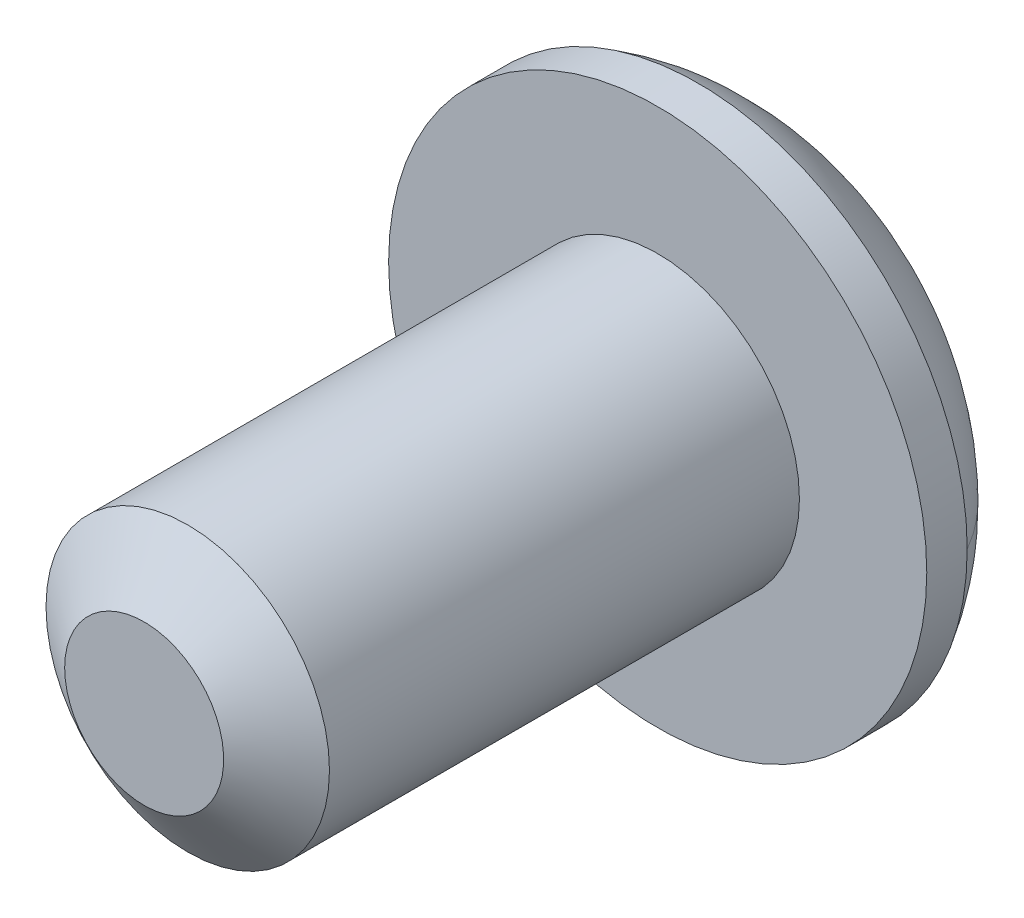
ISO-10303-21;
HEADER;
FILE_DESCRIPTION(('STEP AP214'),'2;1');
FILE_NAME('part.step','',(''),(''),'','','');
FILE_SCHEMA(('AUTOMOTIVE_DESIGN { 1 0 10303 214 1 1 1 1 }'));
ENDSEC;
DATA;
#1=APPLICATION_CONTEXT('core data for automotive mechanical design processes');
#2=APPLICATION_PROTOCOL_DEFINITION('international standard','automotive_design',2000,#1);
#3=PRODUCT_CONTEXT('',#1,'mechanical');
#4=PRODUCT('Part','Part','',(#3));
#5=PRODUCT_RELATED_PRODUCT_CATEGORY('part','',(#4));
#6=PRODUCT_DEFINITION_FORMATION('','',#4);
#7=PRODUCT_DEFINITION_CONTEXT('part definition',#1,'design');
#8=PRODUCT_DEFINITION('design','',#6,#7);
#9=PRODUCT_DEFINITION_SHAPE('','',#8);
#10=(LENGTH_UNIT() NAMED_UNIT(*) SI_UNIT(.MILLI.,.METRE.));
#11=(NAMED_UNIT(*) PLANE_ANGLE_UNIT() SI_UNIT($,.RADIAN.));
#12=(NAMED_UNIT(*) SI_UNIT($,.STERADIAN.) SOLID_ANGLE_UNIT());
#13=UNCERTAINTY_MEASURE_WITH_UNIT(LENGTH_MEASURE(1.E-05),#10,'distance_accuracy_value','');
#14=(GEOMETRIC_REPRESENTATION_CONTEXT(3) GLOBAL_UNCERTAINTY_ASSIGNED_CONTEXT((#13)) GLOBAL_UNIT_ASSIGNED_CONTEXT((#10,
#11,#12)) REPRESENTATION_CONTEXT('',''));
#15=CARTESIAN_POINT('',(0.,0.,0.));
#16=DIRECTION('',(0.,0.,1.));
#17=DIRECTION('',(1.,0.,0.));
#18=AXIS2_PLACEMENT_3D('',#15,#16,#17);
#19=CARTESIAN_POINT('',(-0.994840783,-0.994840783,0.));
#20=DIRECTION('',(0.,0.,1.));
#21=DIRECTION('',(1.,0.,0.));
#22=AXIS2_PLACEMENT_3D('',#19,#20,#21);
#23=PLANE('',#22);
#24=CARTESIAN_POINT('',(0.,0.,0.));
#25=DIRECTION('',(0.,0.,-1.));
#26=DIRECTION('',(-1.,0.,0.));
#27=AXIS2_PLACEMENT_3D('',#24,#25,#26);
#28=CIRCLE('',#27,0.983044252);
#29=CARTESIAN_POINT('',(-0.983044252,0.,0.));
#30=VERTEX_POINT('',#29);
#31=EDGE_CURVE('E22',#30,#30,#28,.F.);
#32=ORIENTED_EDGE('',*,*,#31,.T.);
#33=EDGE_LOOP('',(#32));
#34=FACE_BOUND('',#33,.T.);
#35=ADVANCED_FACE('F17',(#34),#23,.T.);
#36=CARTESIAN_POINT('',(0.,0.,0.));
#37=DIRECTION('',(0.,0.,-1.));
#38=DIRECTION('',(-1.,0.,0.));
#39=AXIS2_PLACEMENT_3D('',#36,#37,#38);
#40=CONICAL_SURFACE('',#39,0.983044252,0.95993108844186);
#41=CARTESIAN_POINT('',(0.,0.,-0.538848736));
#42=DIRECTION('',(0.,0.,1.));
#43=DIRECTION('',(1.,0.,0.));
#44=AXIS2_PLACEMENT_3D('',#41,#42,#43);
#45=CIRCLE('',#44,1.7526);
#46=CARTESIAN_POINT('',(1.7526,0.,-0.538848736));
#47=VERTEX_POINT('',#46);
#48=EDGE_CURVE('E212',#47,#47,#45,.T.);
#49=ORIENTED_EDGE('',*,*,#48,.T.);
#50=EDGE_LOOP('',(#49));
#51=FACE_BOUND('',#50,.T.);
#52=ORIENTED_EDGE('',*,*,#31,.F.);
#53=EDGE_LOOP('',(#52));
#54=FACE_BOUND('',#53,.T.);
#55=ADVANCED_FACE('F332',(#51,#54),#40,.T.);
#56=CARTESIAN_POINT('',(0.,1.14567944,-8.208956791));
#57=DIRECTION('',(-0.499999999861491,0.866025403864407,0.));
#58=DIRECTION('',(-0.866025403864407,-0.499999999861491,0.));
#59=AXIS2_PLACEMENT_3D('',#56,#57,#58);
#60=PLANE('',#59);
#61=CARTESIAN_POINT('',(-2.17394018251591E-11,1.14567943998745,-8.19981818073098));
#62=CARTESIAN_POINT('',(-0.00240805156381278,1.14428915078193,-8.19989611782908));
#63=CARTESIAN_POINT('',(-0.00481610310588616,1.14289886157641,-8.19997405492717));
#64=CARTESIAN_POINT('',(-0.00722415464795953,1.14150857237088,-8.20005199202526));
#65=B_SPLINE_CURVE_WITH_KNOTS('',3,(#61,#62,#63,#64),.UNSPECIFIED.,.F.,.F.,(4,4),(0.,
0.00834501135168709),.UNSPECIFIED.);
#66=CARTESIAN_POINT('',(-1.08696469337784E-11,1.14567943999372,-8.19981818030051));
#67=VERTEX_POINT('',#66);
#68=CARTESIAN_POINT('',(-0.0072241546339118,1.14150857237898,-8.20005199179345));
#69=VERTEX_POINT('',#68);
#70=EDGE_CURVE('E127',#67,#69,#65,.T.);
#71=ORIENTED_EDGE('',*,*,#70,.F.);
#72=DIRECTION('',(0.,0.,1.));
#73=VECTOR('',#72,1.);
#74=CARTESIAN_POINT('',(0.,1.14567944,-7.4624377705));
#75=LINE('',#74,#73);
#76=CARTESIAN_POINT('',(0.,1.14567944,-6.71591875));
#77=VERTEX_POINT('',#76);
#78=EDGE_CURVE('E207',#67,#77,#75,.T.);
#79=ORIENTED_EDGE('',*,*,#78,.T.);
#80=DIRECTION('',(0.866025403864407,0.499999999861491,0.));
#81=VECTOR('',#80,1.);
#82=CARTESIAN_POINT('',(-0.9921875,0.57283972,-6.71591875));
#83=LINE('',#82,#81);
#84=CARTESIAN_POINT('',(-0.9921875,0.57283972,-6.71591875));
#85=VERTEX_POINT('',#84);
#86=EDGE_CURVE('E374',#85,#77,#83,.T.);
#87=ORIENTED_EDGE('',*,*,#86,.F.);
#88=DIRECTION('',(0.,0.,-1.));
#89=VECTOR('',#88,1.);
#90=CARTESIAN_POINT('',(-0.9921875,0.57283972,-7.4624377705));
#91=LINE('',#90,#89);
#92=CARTESIAN_POINT('',(-0.992187500142707,0.572839719663782,-8.19981818071467));
#93=VERTEX_POINT('',#92);
#94=EDGE_CURVE('E123',#85,#93,#91,.T.);
#95=ORIENTED_EDGE('',*,*,#94,.T.);
#96=CARTESIAN_POINT('',(-0.98496334500929,0.577010587827014,-8.20005199201869));
#97=CARTESIAN_POINT('',(-0.987371396767998,0.575620298496415,-8.19997405491337));
#98=CARTESIAN_POINT('',(-0.989779448526706,0.574230009165816,-8.19989611780804));
#99=CARTESIAN_POINT('',(-0.992187500285413,0.572839719835217,-8.19981818070271));
#100=B_SPLINE_CURVE_WITH_KNOTS('',3,(#96,#97,#98,#99),.UNSPECIFIED.,.F.,.F.,(4,4),(0.,
0.00834501210244911),.UNSPECIFIED.);
#101=CARTESIAN_POINT('',(-0.98496334500305,0.577010587830616,-8.20005199183767));
#102=VERTEX_POINT('',#101);
#103=EDGE_CURVE('E117',#102,#93,#100,.T.);
#104=ORIENTED_EDGE('',*,*,#103,.F.);
#105=CARTESIAN_POINT('',(-0.00722415461988427,1.14150857238708,-8.20005199156164));
#106=CARTESIAN_POINT('',(-0.0408963801386112,1.12206790392681,-8.18084167037278));
#107=CARTESIAN_POINT('',(-0.075127160965294,1.10230475340926,-8.16277913739272));
#108=CARTESIAN_POINT('',(-0.144902234608192,1.06202009587368,-8.12974235156948));
#109=CARTESIAN_POINT('',(-0.180452791660929,1.04149497219702,-8.11478589607303));
#110=CARTESIAN_POINT('',(-0.252133905438599,1.00010986187696,-8.08918622467248));
#111=CARTESIAN_POINT('',(-0.288247193617085,0.97925984523349,-8.07848034989405));
#112=CARTESIAN_POINT('',(-0.361247028432008,0.937113370967863,-8.06200560562324));
#113=CARTESIAN_POINT('',(-0.398131502244134,0.91581811009138,-8.05622490259487));
#114=CARTESIAN_POINT('',(-0.462063228462792,0.878907110762914,-8.05100172916337));
#115=CARTESIAN_POINT('',(-0.489033093833781,0.863336051736716,-8.05025546279484));
#116=CARTESIAN_POINT('',(-0.542916729618138,0.832226320123192,-8.05169174720891));
#117=CARTESIAN_POINT('',(-0.569830485626121,0.816687655852819,-8.05387497494316));
#118=CARTESIAN_POINT('',(-0.650179491087969,0.770298135937437,-8.06467257484498));
#119=CARTESIAN_POINT('',(-0.703210451948701,0.739680696420417,-8.07753577221795));
#120=CARTESIAN_POINT('',(-0.794800975521806,0.686800882999798,-8.10801454182573));
#121=CARTESIAN_POINT('',(-0.833850893043051,0.664255402615402,-8.1238218773883));
#122=CARTESIAN_POINT('',(-0.910469440252137,0.620019663775656,-8.15932534890199));
#123=CARTESIAN_POINT('',(-0.948042490373379,0.598326853181894,-8.17900861840243));
#124=CARTESIAN_POINT('',(-0.98496334499681,0.577010587834219,-8.20005199165666));
#125=B_SPLINE_CURVE_WITH_KNOTS('',3,(#105,#106,#107,#108,#109,#110,#111,#112,#113,#114,#115,
#116,#117,#118,#119,#120,#121,#122,#123,#124),.UNSPECIFIED.,.F.,.F.,(4,2,2,2,2,2,2,2,2,4),(0.,
0.130191471457721,0.261109503980019,0.390018803273495,0.518617496223943,0.611935001616784,
0.705274074665428,0.891993311035285,1.03516174852804,1.1778627049345),.UNSPECIFIED.);
#126=EDGE_CURVE('E120',#69,#102,#125,.T.);
#127=ORIENTED_EDGE('',*,*,#126,.F.);
#128=EDGE_LOOP('',(#71,#79,#87,#95,#104,#127));
#129=FACE_BOUND('',#128,.T.);
#130=ADVANCED_FACE('F119',(#129),#60,.F.);
#131=CARTESIAN_POINT('',(0.,0.,-6.35));
#132=DIRECTION('',(0.,0.,1.));
#133=DIRECTION('',(1.,0.,0.));
#134=AXIS2_PLACEMENT_3D('',#131,#132,#133);
#135=CYLINDRICAL_SURFACE('',#134,1.7526);
#136=ORIENTED_EDGE('',*,*,#48,.F.);
#137=EDGE_LOOP('',(#136));
#138=FACE_BOUND('',#137,.T.);
#139=CARTESIAN_POINT('',(0.,0.,-6.35));
#140=DIRECTION('',(0.,0.,1.));
#141=DIRECTION('',(1.,0.,0.));
#142=AXIS2_PLACEMENT_3D('',#139,#140,#141);
#143=CIRCLE('',#142,1.7526);
#144=CARTESIAN_POINT('',(1.7526,0.,-6.35));
#145=VERTEX_POINT('',#144);
#146=EDGE_CURVE('E131',#145,#145,#143,.T.);
#147=ORIENTED_EDGE('',*,*,#146,.T.);
#148=EDGE_LOOP('',(#147));
#149=FACE_BOUND('',#148,.T.);
#150=ADVANCED_FACE('F331',(#138,#149),#135,.T.);
#151=CARTESIAN_POINT('',(0.9921875,0.57283972,-8.208956791));
#152=DIRECTION('',(0.499999999861491,0.866025403864407,0.));
#153=DIRECTION('',(-0.866025403864407,0.499999999861491,0.));
#154=AXIS2_PLACEMENT_3D('',#151,#152,#153);
#155=PLANE('',#154);
#156=CARTESIAN_POINT('',(0.992187500285413,0.572839719835217,-8.19981818070271));
#157=CARTESIAN_POINT('',(0.989779448546503,0.57423000915439,-8.19989611780741));
#158=CARTESIAN_POINT('',(0.987371396807592,0.575620298473564,-8.19997405491211));
#159=CARTESIAN_POINT('',(0.984963345068681,0.577010587792737,-8.2000519920168));
#160=B_SPLINE_CURVE_WITH_KNOTS('',3,(#156,#157,#158,#159),.UNSPECIFIED.,.F.,.F.,(4,4),(0.,
0.0083450120338504),.UNSPECIFIED.);
#161=CARTESIAN_POINT('',(0.992187500142707,0.572839719917608,-8.19981818028637));
#162=VERTEX_POINT('',#161);
#163=CARTESIAN_POINT('',(0.984963345056635,0.577010587799679,-8.20005199185037));
#164=VERTEX_POINT('',#163);
#165=EDGE_CURVE('E210',#162,#164,#160,.T.);
#166=ORIENTED_EDGE('',*,*,#165,.F.);
#167=DIRECTION('',(0.,0.,1.));
#168=VECTOR('',#167,1.);
#169=CARTESIAN_POINT('',(0.9921875,0.57283972,-7.4624377705));
#170=LINE('',#169,#168);
#171=CARTESIAN_POINT('',(0.9921875,0.57283972,-6.71591875));
#172=VERTEX_POINT('',#171);
#173=EDGE_CURVE('E413',#162,#172,#170,.T.);
#174=ORIENTED_EDGE('',*,*,#173,.T.);
#175=DIRECTION('',(0.866025403864407,-0.499999999861491,0.));
#176=VECTOR('',#175,1.);
#177=CARTESIAN_POINT('',(0.,1.14567944,-6.71591875));
#178=LINE('',#177,#176);
#179=EDGE_CURVE('E376',#77,#172,#178,.T.);
#180=ORIENTED_EDGE('',*,*,#179,.F.);
#181=ORIENTED_EDGE('',*,*,#78,.F.);
#182=CARTESIAN_POINT('',(0.00722415470734373,1.14150857233659,-8.20005199202715));
#183=CARTESIAN_POINT('',(0.00481610314547566,1.14289886155354,-8.19997405492842));
#184=CARTESIAN_POINT('',(0.00240805158360758,1.1442891507705,-8.1998961178297));
#185=CARTESIAN_POINT('',(2.17395051227346E-11,1.14567943998745,-8.19981818073098));
#186=B_SPLINE_CURVE_WITH_KNOTS('',3,(#182,#183,#184,#185),.UNSPECIFIED.,.F.,.F.,(4,4),(0.,
0.00834501142028877),.UNSPECIFIED.);
#187=CARTESIAN_POINT('',(0.00722415468749791,1.14150857234805,-8.20005199178075));
#188=VERTEX_POINT('',#187);
#189=EDGE_CURVE('E211',#188,#67,#186,.T.);
#190=ORIENTED_EDGE('',*,*,#189,.F.);
#191=CARTESIAN_POINT('',(0.984963345044577,0.57701058780664,-8.20005199168393));
#192=CARTESIAN_POINT('',(0.951291119513632,0.596451256273965,-8.18084167048179));
#193=CARTESIAN_POINT('',(0.917060338674405,0.616214406798764,-8.16277913748865));
#194=CARTESIAN_POINT('',(0.847285265005212,0.65649906434952,-8.12974235164038));
#195=CARTESIAN_POINT('',(0.81173470793871,0.677024188034124,-8.114785896132));
#196=CARTESIAN_POINT('',(0.740053594132381,0.718409298370735,-8.08918622471004));
#197=CARTESIAN_POINT('',(0.703940305939011,0.739259315022798,-8.07848034992211));
#198=CARTESIAN_POINT('',(0.630940471093368,0.781405789306161,-8.06200560563602));
#199=CARTESIAN_POINT('',(0.59405599726541,0.802701050191785,-8.05622490260184));
#200=CARTESIAN_POINT('',(0.530124271030073,0.839612049529881,-8.05100172916529));
#201=CARTESIAN_POINT('',(0.503154405658425,0.855183108556459,-8.05025546279521));
#202=CARTESIAN_POINT('',(0.449270769872635,0.88629284017081,-8.05169174720633));
#203=CARTESIAN_POINT('',(0.422357013863878,0.90183150444163,-8.0538749749392));
#204=CARTESIAN_POINT('',(0.342008008400041,0.948221024358161,-8.06467257483717));
#205=CARTESIAN_POINT('',(0.288977047537942,0.97883846387597,-8.07753577220797));
#206=CARTESIAN_POINT('',(0.197386523995788,1.03171827727872,-8.10801454180169));
#207=CARTESIAN_POINT('',(0.158336606505677,1.05426375764514,-8.12382187734785));
#208=CARTESIAN_POINT('',(0.0817180593562454,1.09849949645044,-8.15932534882368));
#209=CARTESIAN_POINT('',(0.0441450092635433,1.12019230702773,-8.17900861830273));
#210=CARTESIAN_POINT('',(0.00722415466765243,1.1415085723595,-8.20005199153436));
#211=B_SPLINE_CURVE_WITH_KNOTS('',3,(#191,#192,#193,#194,#195,#196,#197,#198,#199,#200,#201,
#202,#203,#204,#205,#206,#207,#208,#209,#210),.UNSPECIFIED.,.F.,.F.,(4,2,2,2,2,2,2,2,2,4),(0.,
0.130191471513434,0.261109504092686,0.390018803442961,0.518617496449662,0.611935001844895,
0.705274074895911,0.891993311268867,1.03516174864398,1.17786270493446),.UNSPECIFIED.);
#212=EDGE_CURVE('E132',#164,#188,#211,.T.);
#213=ORIENTED_EDGE('',*,*,#212,.F.);
#214=EDGE_LOOP('',(#166,#174,#180,#181,#190,#213));
#215=FACE_BOUND('',#214,.T.);
#216=ADVANCED_FACE('F334',(#215),#155,.F.);
#217=CARTESIAN_POINT('',(0.9921875,-1.14567944,-6.71591875));
#218=DIRECTION('',(0.,0.,-1.));
#219=DIRECTION('',(-1.,0.,0.));
#220=AXIS2_PLACEMENT_3D('',#217,#218,#219);
#221=PLANE('',#220);
#222=DIRECTION('',(-0.866025403864407,0.499999999861491,0.));
#223=VECTOR('',#222,1.);
#224=CARTESIAN_POINT('',(-0.49609375,-0.85925958,-6.71591875));
#225=LINE('',#224,#223);
#226=CARTESIAN_POINT('',(0.,-1.14567944,-6.71591875));
#227=VERTEX_POINT('',#226);
#228=CARTESIAN_POINT('',(-0.9921875,-0.57283972,-6.71591875));
#229=VERTEX_POINT('',#228);
#230=EDGE_CURVE('E187',#227,#229,#225,.T.);
#231=ORIENTED_EDGE('',*,*,#230,.T.);
#232=DIRECTION('',(0.,1.,0.));
#233=VECTOR('',#232,1.);
#234=CARTESIAN_POINT('',(-0.9921875,0.,-6.71591875));
#235=LINE('',#234,#233);
#236=EDGE_CURVE('E199',#229,#85,#235,.T.);
#237=ORIENTED_EDGE('',*,*,#236,.T.);
#238=ORIENTED_EDGE('',*,*,#86,.T.);
#239=ORIENTED_EDGE('',*,*,#179,.T.);
#240=DIRECTION('',(0.,-1.,0.));
#241=VECTOR('',#240,1.);
#242=CARTESIAN_POINT('',(0.9921875,0.,-6.71591875));
#243=LINE('',#242,#241);
#244=CARTESIAN_POINT('',(0.9921875,-0.57283972,-6.71591875));
#245=VERTEX_POINT('',#244);
#246=EDGE_CURVE('E417',#172,#245,#243,.T.);
#247=ORIENTED_EDGE('',*,*,#246,.T.);
#248=DIRECTION('',(-0.866025403864407,-0.499999999861491,0.));
#249=VECTOR('',#248,1.);
#250=CARTESIAN_POINT('',(0.49609375,-0.85925958,-6.71591875));
#251=LINE('',#250,#249);
#252=EDGE_CURVE('E184',#245,#227,#251,.T.);
#253=ORIENTED_EDGE('',*,*,#252,.T.);
#254=EDGE_LOOP('',(#231,#237,#238,#239,#247,#253));
#255=FACE_BOUND('',#254,.T.);
#256=ADVANCED_FACE('F391',(#255),#221,.T.);
#257=CARTESIAN_POINT('',(-0.9921875,0.57283972,-8.208956791));
#258=DIRECTION('',(-1.,0.,0.));
#259=DIRECTION('',(0.,-1.,0.));
#260=AXIS2_PLACEMENT_3D('',#257,#258,#259);
#261=PLANE('',#260);
#262=CARTESIAN_POINT('',(-0.9921875,0.572839719492348,-8.19981818072663));
#263=CARTESIAN_POINT('',(-0.992187500000002,0.570059141212099,-8.1998961178211));
#264=CARTESIAN_POINT('',(-0.992187500000003,0.56727856293185,-8.19997405491557));
#265=CARTESIAN_POINT('',(-0.992187500000005,0.564497984651601,-8.20005199201003));
#266=B_SPLINE_CURVE_WITH_KNOTS('',3,(#262,#263,#264,#265),.UNSPECIFIED.,.F.,.F.,(4,4),(0.,
0.0083450109568273),.UNSPECIFIED.);
#267=CARTESIAN_POINT('',(-0.9921875,0.564497984613562,-8.20005199189597));
#268=VERTEX_POINT('',#267);
#269=EDGE_CURVE('E206',#93,#268,#266,.T.);
#270=ORIENTED_EDGE('',*,*,#269,.F.);
#271=ORIENTED_EDGE('',*,*,#94,.F.);
#272=ORIENTED_EDGE('',*,*,#236,.F.);
#273=DIRECTION('',(0.,0.,-1.));
#274=VECTOR('',#273,1.);
#275=CARTESIAN_POINT('',(-0.9921875,-0.57283972,-7.4624377705));
#276=LINE('',#275,#274);
#277=CARTESIAN_POINT('',(-0.992187500142707,-0.572839719663782,-8.19981818071467));
#278=VERTEX_POINT('',#277);
#279=EDGE_CURVE('E190',#229,#278,#276,.T.);
#280=ORIENTED_EDGE('',*,*,#279,.T.);
#281=CARTESIAN_POINT('',(-0.9921875,-0.5644979844076,-8.20005199201674));
#282=CARTESIAN_POINT('',(-0.9921875,-0.567278562769183,-8.19997405492004));
#283=CARTESIAN_POINT('',(-0.9921875,-0.570059141130765,-8.19989611782333));
#284=CARTESIAN_POINT('',(-0.9921875,-0.572839719492348,-8.19981818072663));
#285=B_SPLINE_CURVE_WITH_KNOTS('',3,(#281,#282,#283,#284),.UNSPECIFIED.,.F.,.F.,(4,4),(0.,
0.00834501120092019),.UNSPECIFIED.);
#286=CARTESIAN_POINT('',(-0.9921875,-0.564497984393444,-8.20005199185081));
#287=VERTEX_POINT('',#286);
#288=EDGE_CURVE('E202',#287,#278,#285,.T.);
#289=ORIENTED_EDGE('',*,*,#288,.F.);
#290=CARTESIAN_POINT('',(-0.9921875,0.564497984575505,-8.20005199178191));
#291=CARTESIAN_POINT('',(-0.9921875,0.525616647652904,-8.18084167059791));
#292=CARTESIAN_POINT('',(-0.9921875,0.48609034661574,-8.16277913762251));
#293=CARTESIAN_POINT('',(-0.9921875,0.405521031540782,-8.12974235180759));
#294=CARTESIAN_POINT('',(-0.9921875,0.364470784185713,-8.11478589631477));
#295=CARTESIAN_POINT('',(-0.9921875,0.281700563540988,-8.08918622491914));
#296=CARTESIAN_POINT('',(-0.9921875,0.240000530251159,-8.07848035014215));
#297=CARTESIAN_POINT('',(-0.9921875,0.155707581714097,-8.06200560587186));
#298=CARTESIAN_POINT('',(-0.9921875,0.113117059958207,-8.05622490284258));
#299=CARTESIAN_POINT('',(-0.9921875,0.0392950612908393,-8.05100172940685));
#300=CARTESIAN_POINT('',(-0.9921875,0.00815294323097302,-8.05025546303611));
#301=CARTESIAN_POINT('',(-0.9921875,-0.0540665200112253,-8.05169174744544));
#302=CARTESIAN_POINT('',(-0.9921875,-0.0851438485596516,-8.05387497517717));
#303=CARTESIAN_POINT('',(-0.9921875,-0.177922888413106,-8.06467257507115));
#304=CARTESIAN_POINT('',(-0.9921875,-0.239157767462442,-8.07753577243853));
#305=CARTESIAN_POINT('',(-0.9921875,-0.34491739426966,-8.1080145420197));
#306=CARTESIAN_POINT('',(-0.9921875,-0.39000835499135,-8.12382187755426));
#307=CARTESIAN_POINT('',(-0.9921875,-0.478479832580791,-8.15932534900388));
#308=CARTESIAN_POINT('',(-0.9921875,-0.521865453725344,-8.17900861846834));
#309=CARTESIAN_POINT('',(-0.9921875,-0.564497984379288,-8.20005199168488));
#310=B_SPLINE_CURVE_WITH_KNOTS('',3,(#290,#291,#292,#293,#294,#295,#296,#297,#298,#299,#300,
#301,#302,#303,#304,#305,#306,#307,#308,#309),.UNSPECIFIED.,.F.,.F.,(4,2,2,2,2,2,2,2,2,4),(0.,
0.130191471427734,0.261109503919272,0.390018803186663,0.518617496111365,0.611935001500923,
0.705274074546285,0.891993310907698,1.03516174820459,1.17786270441711),.UNSPECIFIED.);
#311=EDGE_CURVE('E293',#268,#287,#310,.T.);
#312=ORIENTED_EDGE('',*,*,#311,.F.);
#313=EDGE_LOOP('',(#270,#271,#272,#280,#289,#312));
#314=FACE_BOUND('',#313,.T.);
#315=ADVANCED_FACE('F277',(#314),#261,.F.);
#316=CARTESIAN_POINT('',(-0.9921875,-0.57283972,-8.208956791));
#317=DIRECTION('',(-0.499999999861491,-0.866025403864407,0.));
#318=DIRECTION('',(0.866025403864407,-0.499999999861491,0.));
#319=AXIS2_PLACEMENT_3D('',#316,#317,#318);
#320=PLANE('',#319);
#321=CARTESIAN_POINT('',(-0.992187500285413,-0.572839719835216,-8.19981818070271));
#322=CARTESIAN_POINT('',(-0.989779448511282,-0.574230009174725,-8.19989611780853));
#323=CARTESIAN_POINT('',(-0.98737139673715,-0.575620298514234,-8.19997405491434));
#324=CARTESIAN_POINT('',(-0.984963344963019,-0.577010587853743,-8.20005199202016));
#325=B_SPLINE_CURVE_WITH_KNOTS('',3,(#321,#322,#323,#324),.UNSPECIFIED.,.F.,.F.,(4,4),(0.,
0.00834501215590573),.UNSPECIFIED.);
#326=CARTESIAN_POINT('',(-0.984963344961321,-0.577010587854708,-8.20005199182779));
#327=VERTEX_POINT('',#326);
#328=EDGE_CURVE('E196',#278,#327,#325,.T.);
#329=ORIENTED_EDGE('',*,*,#328,.F.);
#330=ORIENTED_EDGE('',*,*,#279,.F.);
#331=ORIENTED_EDGE('',*,*,#230,.F.);
#332=DIRECTION('',(0.,0.,-1.));
#333=VECTOR('',#332,1.);
#334=CARTESIAN_POINT('',(0.,-1.14567944,-7.4624377705));
#335=LINE('',#334,#333);
#336=CARTESIAN_POINT('',(0.,-1.14567943998745,-8.19981818073098));
#337=VERTEX_POINT('',#336);
#338=EDGE_CURVE('E177',#227,#337,#335,.T.);
#339=ORIENTED_EDGE('',*,*,#338,.T.);
#340=CARTESIAN_POINT('',(-0.00722415460168103,-1.14150857239759,-8.20005199202379));
#341=CARTESIAN_POINT('',(-0.0048161030750338,-1.14289886159421,-8.19997405492619));
#342=CARTESIAN_POINT('',(-0.00240805154838657,-1.14428915079083,-8.19989611782858));
#343=CARTESIAN_POINT('',(-2.17393424711653E-11,-1.14567943998745,-8.19981818073098));
#344=B_SPLINE_CURVE_WITH_KNOTS('',3,(#340,#341,#342,#343),.UNSPECIFIED.,.F.,.F.,(4,4),(0.,
0.00834501129823398),.UNSPECIFIED.);
#345=CARTESIAN_POINT('',(-0.00722415459218422,-1.14150857240308,-8.20005199180333));
#346=VERTEX_POINT('',#345);
#347=EDGE_CURVE('E191',#346,#337,#344,.T.);
#348=ORIENTED_EDGE('',*,*,#347,.F.);
#349=CARTESIAN_POINT('',(-0.984963344959612,-0.577010587855695,-8.20005199163542));
#350=CARTESIAN_POINT('',(-0.951291119433514,-0.596451256320221,-8.18084167043854));
#351=CARTESIAN_POINT('',(-0.917060338599264,-0.616214406842147,-8.1627791374506));
#352=CARTESIAN_POINT('',(-0.847285264940503,-0.656499064386879,-8.12974235161225));
#353=CARTESIAN_POINT('',(-0.811734707879462,-0.677024188068331,-8.1147858961086));
#354=CARTESIAN_POINT('',(-0.740053594084502,-0.718409298398377,-8.08918622469514));
#355=CARTESIAN_POINT('',(-0.703940305897037,-0.739259315047032,-8.07848034991098));
#356=CARTESIAN_POINT('',(-0.630940471063581,-0.781405789323359,-8.06200560563095));
#357=CARTESIAN_POINT('',(-0.594055997241904,-0.802701050205356,-8.05622490259907));
#358=CARTESIAN_POINT('',(-0.530124271013184,-0.839612049539632,-8.05100172916453));
#359=CARTESIAN_POINT('',(-0.503154405641797,-0.855183108566059,-8.05025546279506));
#360=CARTESIAN_POINT('',(-0.449270769856575,-0.886292840180082,-8.05169174720735));
#361=CARTESIAN_POINT('',(-0.422357013848126,-0.901831504450725,-8.05387497494077));
#362=CARTESIAN_POINT('',(-0.342008008385078,-0.9482210243668,-8.06467257484027));
#363=CARTESIAN_POINT('',(-0.288977047523521,-0.978838463884295,-8.07753577221193));
#364=CARTESIAN_POINT('',(-0.197386523969088,-1.03171827729413,-8.10801454181122));
#365=CARTESIAN_POINT('',(-0.158336606466625,-1.05426375766769,-8.1238218773639));
#366=CARTESIAN_POINT('',(-0.0817180592935279,-1.09849949648665,-8.15932534885475));
#367=CARTESIAN_POINT('',(-0.0441450091895037,-1.12019230707048,-8.17900861834228));
#368=CARTESIAN_POINT('',(-0.00722415458268747,-1.14150857240856,-8.20005199158288));
#369=B_SPLINE_CURVE_WITH_KNOTS('',3,(#349,#350,#351,#352,#353,#354,#355,#356,#357,#358,#359,
#360,#361,#362,#363,#364,#365,#366,#367,#368),.UNSPECIFIED.,.F.,.F.,(4,2,2,2,2,2,2,2,2,4),(0.,
0.130191471491331,0.261109504047988,0.39001880337573,0.518617496360115,0.611935001754399,
0.705274074804474,0.8919933111762,1.03516174859799,1.17786270493447),.UNSPECIFIED.);
#370=EDGE_CURVE('E285',#327,#346,#369,.T.);
#371=ORIENTED_EDGE('',*,*,#370,.F.);
#372=EDGE_LOOP('',(#329,#330,#331,#339,#348,#371));
#373=FACE_BOUND('',#372,.T.);
#374=ADVANCED_FACE('F272',(#373),#320,.F.);
#375=CARTESIAN_POINT('',(0.,-1.14567944,-8.208956791));
#376=DIRECTION('',(0.499999999861491,-0.866025403864407,0.));
#377=DIRECTION('',(0.866025403864407,0.499999999861491,0.));
#378=AXIS2_PLACEMENT_3D('',#375,#376,#377);
#379=PLANE('',#378);
#380=CARTESIAN_POINT('',(2.17392938675568E-11,-1.14567943998745,-8.19981818073098));
#381=CARTESIAN_POINT('',(0.0024080515990336,-1.14428915076159,-8.19989611783019));
#382=CARTESIAN_POINT('',(0.00481610317632791,-1.14289886153574,-8.1999740549294));
#383=CARTESIAN_POINT('',(0.00722415475362221,-1.14150857230988,-8.20005199202861));
#384=B_SPLINE_CURVE_WITH_KNOTS('',3,(#380,#381,#382,#383),.UNSPECIFIED.,.F.,.F.,(4,4),(0.,
0.00834501147374209),.UNSPECIFIED.);
#385=CARTESIAN_POINT('',(0.00722415472922564,-1.14150857232395,-8.20005199177087));
#386=VERTEX_POINT('',#385);
#387=EDGE_CURVE('E183',#337,#386,#384,.T.);
#388=ORIENTED_EDGE('',*,*,#387,.F.);
#389=ORIENTED_EDGE('',*,*,#338,.F.);
#390=ORIENTED_EDGE('',*,*,#252,.F.);
#391=DIRECTION('',(0.,0.,-1.));
#392=VECTOR('',#391,1.);
#393=CARTESIAN_POINT('',(0.9921875,-0.57283972,-7.4624377705));
#394=LINE('',#393,#392);
#395=CARTESIAN_POINT('',(0.992187500142707,-0.572839719663782,-8.19981818071467));
#396=VERTEX_POINT('',#395);
#397=EDGE_CURVE('E419',#245,#396,#394,.T.);
#398=ORIENTED_EDGE('',*,*,#397,.T.);
#399=CARTESIAN_POINT('',(0.984963345114952,-0.577010587766009,-8.20005199201534));
#400=CARTESIAN_POINT('',(0.987371396838439,-0.575620298455745,-8.19997405491113));
#401=CARTESIAN_POINT('',(0.989779448561926,-0.574230009145481,-8.19989611780692));
#402=CARTESIAN_POINT('',(0.992187500285413,-0.572839719835217,-8.19981818070271));
#403=B_SPLINE_CURVE_WITH_KNOTS('',3,(#399,#400,#401,#402),.UNSPECIFIED.,.F.,.F.,(4,4),(0.,
0.00834501198039468),.UNSPECIFIED.);
#404=CARTESIAN_POINT('',(0.984963345098363,-0.577010587775587,-8.20005199186025));
#405=VERTEX_POINT('',#404);
#406=EDGE_CURVE('E265',#405,#396,#403,.T.);
#407=ORIENTED_EDGE('',*,*,#406,.F.);
#408=CARTESIAN_POINT('',(0.00722415470484945,-1.14150857233803,-8.20005199151312));
#409=CARTESIAN_POINT('',(0.0408963802187291,-1.12206790388056,-8.18084167032953));
#410=CARTESIAN_POINT('',(0.0751271610404354,-1.10230475336587,-8.16277913735466));
#411=CARTESIAN_POINT('',(0.144902234672901,-1.06202009583632,-8.12974235154136));
#412=CARTESIAN_POINT('',(0.180452791720177,-1.04149497216282,-8.11478589604963));
#413=CARTESIAN_POINT('',(0.252133905486476,-1.00010986184932,-8.08918622465758));
#414=CARTESIAN_POINT('',(0.288247193659058,-0.979259845209257,-8.07848034988292));
#415=CARTESIAN_POINT('',(0.361247028461793,-0.937113370950666,-8.06200560561817));
#416=CARTESIAN_POINT('',(0.398131502267638,-0.91581811007781,-8.0562249025921));
#417=CARTESIAN_POINT('',(0.462063228479679,-0.878907110753164,-8.0510017291626));
#418=CARTESIAN_POINT('',(0.489033093850407,-0.863336051727117,-8.05025546279469));
#419=CARTESIAN_POINT('',(0.542916729634195,-0.832226320113922,-8.05169174720993));
#420=CARTESIAN_POINT('',(0.569830485641871,-0.816687655843725,-8.05387497494473));
#421=CARTESIAN_POINT('',(0.650179491102929,-0.770298135928799,-8.06467257484807));
#422=CARTESIAN_POINT('',(0.703210451963119,-0.739680696412093,-8.07753577222191));
#423=CARTESIAN_POINT('',(0.794800975548503,-0.686800882984384,-8.10801454183527));
#424=CARTESIAN_POINT('',(0.8338508930821,-0.664255402592856,-8.12382187740435));
#425=CARTESIAN_POINT('',(0.910469440314853,-0.620019663739447,-8.15932534893306));
#426=CARTESIAN_POINT('',(0.948042490447418,-0.598326853139148,-8.17900861844198));
#427=CARTESIAN_POINT('',(0.984963345081775,-0.577010587785165,-8.20005199170517));
#428=B_SPLINE_CURVE_WITH_KNOTS('',3,(#408,#409,#410,#411,#412,#413,#414,#415,#416,#417,#418,
#419,#420,#421,#422,#423,#424,#425,#426,#427),.UNSPECIFIED.,.F.,.F.,(4,2,2,2,2,2,2,2,2,4),(0.,
0.130191471435618,0.261109503935319,0.390018803206261,0.518617496134393,0.611935001526285,
0.705274074573987,0.891993310942615,1.03516174848204,1.17786270493452),.UNSPECIFIED.);
#429=EDGE_CURVE('E292',#386,#405,#428,.T.);
#430=ORIENTED_EDGE('',*,*,#429,.F.);
#431=EDGE_LOOP('',(#388,#389,#390,#398,#407,#430));
#432=FACE_BOUND('',#431,.T.);
#433=ADVANCED_FACE('F276',(#432),#379,.F.);
#434=CARTESIAN_POINT('',(0.,0.,-8.04965979531073));
#435=DIRECTION('',(0.,0.,-1.));
#436=DIRECTION('',(-1.,0.,0.));
#437=AXIS2_PLACEMENT_3D('',#434,#435,#436);
#438=CONICAL_SURFACE('',#437,0.99113923627097,0.785398160204984);
#439=ORIENTED_EDGE('',*,*,#212,.T.);
#440=CARTESIAN_POINT('',(0.,0.,-8.200051992));
#441=DIRECTION('',(0.,0.,1.));
#442=DIRECTION('',(1.,0.,0.));
#443=AXIS2_PLACEMENT_3D('',#440,#441,#442);
#444=CIRCLE('',#443,1.141531432);
#445=EDGE_CURVE('E137',#164,#188,#444,.T.);
#446=ORIENTED_EDGE('',*,*,#445,.F.);
#447=EDGE_LOOP('',(#439,#446));
#448=FACE_BOUND('',#447,.T.);
#449=ADVANCED_FACE('F317',(#448),#438,.F.);
#450=CARTESIAN_POINT('',(0.,0.,-8.04965979531073));
#451=DIRECTION('',(0.,0.,-1.));
#452=DIRECTION('',(-1.,0.,0.));
#453=AXIS2_PLACEMENT_3D('',#450,#451,#452);
#454=CONICAL_SURFACE('',#453,0.99113923627097,0.785398160204984);
#455=ORIENTED_EDGE('',*,*,#126,.T.);
#456=CARTESIAN_POINT('',(0.,0.,-8.200051992));
#457=DIRECTION('',(0.,0.,1.));
#458=DIRECTION('',(1.,0.,0.));
#459=AXIS2_PLACEMENT_3D('',#456,#457,#458);
#460=CIRCLE('',#459,1.141531432);
#461=EDGE_CURVE('E130',#69,#102,#460,.T.);
#462=ORIENTED_EDGE('',*,*,#461,.F.);
#463=EDGE_LOOP('',(#455,#462));
#464=FACE_BOUND('',#463,.T.);
#465=ADVANCED_FACE('F129',(#464),#454,.F.);
#466=CARTESIAN_POINT('',(3.3673288,-3.3673288,-6.35));
#467=DIRECTION('',(0.,0.,-1.));
#468=DIRECTION('',(-1.,0.,0.));
#469=AXIS2_PLACEMENT_3D('',#466,#467,#468);
#470=PLANE('',#469);
#471=ORIENTED_EDGE('',*,*,#146,.F.);
#472=EDGE_LOOP('',(#471));
#473=FACE_BOUND('',#472,.T.);
#474=CARTESIAN_POINT('',(0.,0.,-6.35));
#475=DIRECTION('',(0.,0.,1.));
#476=DIRECTION('',(1.,0.,0.));
#477=AXIS2_PLACEMENT_3D('',#474,#475,#476);
#478=CIRCLE('',#477,3.3274);
#479=CARTESIAN_POINT('',(3.3274,0.,-6.35));
#480=VERTEX_POINT('',#479);
#481=EDGE_CURVE('E136',#480,#480,#478,.T.);
#482=ORIENTED_EDGE('',*,*,#481,.T.);
#483=EDGE_LOOP('',(#482));
#484=FACE_BOUND('',#483,.T.);
#485=ADVANCED_FACE('F316',(#473,#484),#470,.F.);
#486=CARTESIAN_POINT('',(0.9921875,-0.57283972,-6.71591875));
#487=DIRECTION('',(1.,0.,0.));
#488=DIRECTION('',(0.,0.,-1.));
#489=AXIS2_PLACEMENT_3D('',#486,#487,#488);
#490=PLANE('',#489);
#491=CARTESIAN_POINT('',(0.9921875,-0.572839719492347,-8.19981818072663));
#492=CARTESIAN_POINT('',(0.992187500000002,-0.570059141130511,-8.19989611782334));
#493=CARTESIAN_POINT('',(0.992187500000004,-0.567278562768675,-8.19997405492005));
#494=CARTESIAN_POINT('',(0.992187500000006,-0.564497984406839,-8.20005199201676));
#495=B_SPLINE_CURVE_WITH_KNOTS('',3,(#491,#492,#493,#494),.UNSPECIFIED.,.F.,.F.,(4,4),(0.,
0.00834501120168207),.UNSPECIFIED.);
#496=CARTESIAN_POINT('',(0.9921875,-0.564497984673405,-8.20005199183033));
#497=VERTEX_POINT('',#496);
#498=EDGE_CURVE('E251',#396,#497,#495,.T.);
#499=ORIENTED_EDGE('',*,*,#498,.F.);
#500=ORIENTED_EDGE('',*,*,#397,.F.);
#501=ORIENTED_EDGE('',*,*,#246,.F.);
#502=ORIENTED_EDGE('',*,*,#173,.F.);
#503=CARTESIAN_POINT('',(0.9921875,0.564497984583024,-8.20005199201191));
#504=CARTESIAN_POINT('',(0.9921875,0.567278562886132,-8.19997405491682));
#505=CARTESIAN_POINT('',(0.9921875,0.57005914118924,-8.19989611782173));
#506=CARTESIAN_POINT('',(0.9921875,0.572839719492348,-8.19981818072663));
#507=B_SPLINE_CURVE_WITH_KNOTS('',3,(#503,#504,#505,#506),.UNSPECIFIED.,.F.,.F.,(4,4),(0.,
0.00834501102543051),.UNSPECIFIED.);
#508=CARTESIAN_POINT('',(0.9921875,0.564497984551688,-8.20005199188327));
#509=VERTEX_POINT('',#508);
#510=EDGE_CURVE('E143',#509,#162,#507,.T.);
#511=ORIENTED_EDGE('',*,*,#510,.F.);
#512=CARTESIAN_POINT('',(0.9921875,-0.564497984330282,-8.20005199166064));
#513=CARTESIAN_POINT('',(0.9921875,-0.525856120653313,-8.18095942489862));
#514=CARTESIAN_POINT('',(0.9921875,-0.486576931756551,-8.16300121385504));
#515=CARTESIAN_POINT('',(0.9921875,-0.406495578877815,-8.13011952017487));
#516=CARTESIAN_POINT('',(0.9921875,-0.365685507965727,-8.11521546268213));
#517=CARTESIAN_POINT('',(0.9921875,-0.282922660456024,-8.08951256880759));
#518=CARTESIAN_POINT('',(0.9921875,-0.240974602600463,-8.07869893534966));
#519=CARTESIAN_POINT('',(0.9921875,-0.156184348379614,-8.0620712452462));
#520=CARTESIAN_POINT('',(0.9921875,-0.113345223973493,-8.05624223548608));
#521=CARTESIAN_POINT('',(0.9921875,-0.0586300957327167,-8.05236943053479));
#522=CARTESIAN_POINT('',(0.9921875,-0.0469099293549988,-8.05174712351888));
#523=CARTESIAN_POINT('',(0.9921875,-0.0234603873842513,-8.05091634775237));
#524=CARTESIAN_POINT('',(0.9921875,-0.0117310190787873,-8.05070767714924));
#525=CARTESIAN_POINT('',(0.9921875,0.0301119711668331,-8.05070904272715));
#526=CARTESIAN_POINT('',(0.9921875,0.0602348191621563,-8.05208743863049));
#527=CARTESIAN_POINT('',(0.9921875,0.120245505032822,-8.05751918420648));
#528=CARTESIAN_POINT('',(0.9921875,0.150133163017433,-8.06157441168218));
#529=CARTESIAN_POINT('',(0.9921875,0.239389997474185,-8.07750018847232));
#530=CARTESIAN_POINT('',(0.9921875,0.298109254423328,-8.09312821720221));
#531=CARTESIAN_POINT('',(0.9921875,0.391475355190458,-8.12459967455431));
#532=CARTESIAN_POINT('',(0.9921875,0.426940523333453,-8.13819378598662));
#533=CARTESIAN_POINT('',(0.9921875,0.496579110352738,-8.16759864790838));
#534=CARTESIAN_POINT('',(0.9921875,0.530761147023974,-8.18338885092698));
#535=CARTESIAN_POINT('',(0.9921875,0.564497984520352,-8.20005199175463));
#536=B_SPLINE_CURVE_WITH_KNOTS('',3,(#512,#513,#514,#515,#516,#517,#518,#519,#520,#521,#522,
#523,#524,#525,#526,#527,#528,#529,#530,#531,#532,#533,#534,#535),.UNSPECIFIED.,.F.,.F.,(4,2,2,
2,2,2,2,2,2,2,2,4),(0.,0.129390298284524,0.25957961893542,0.389293371379023,0.518616623363715,
0.553821629362377,0.589009451258335,0.679331925952622,0.769717829487316,0.951211304576446,
1.0650893684517,1.17796584701175),.UNSPECIFIED.);
#537=EDGE_CURVE('E140',#497,#509,#536,.T.);
#538=ORIENTED_EDGE('',*,*,#537,.F.);
#539=EDGE_LOOP('',(#499,#500,#501,#502,#511,#538));
#540=FACE_BOUND('',#539,.T.);
#541=ADVANCED_FACE('F19',(#540),#490,.F.);
#542=CARTESIAN_POINT('',(0.,0.,-8.04980790550987));
#543=DIRECTION('',(0.,0.,-1.));
#544=DIRECTION('',(0.,1.,0.));
#545=AXIS2_PLACEMENT_3D('',#542,#543,#544);
#546=CONICAL_SURFACE('',#545,0.991287346503609,0.785398160090367);
#547=CARTESIAN_POINT('',(0.,0.,-8.200051992));
#548=DIRECTION('',(0.,0.,1.));
#549=DIRECTION('',(1.,0.,0.));
#550=AXIS2_PLACEMENT_3D('',#547,#548,#549);
#551=CIRCLE('',#550,1.141531432);
#552=CARTESIAN_POINT('',(-1.141531432,1.17066005230608E-10,-8.200051992));
#553=VERTEX_POINT('',#552);
#554=EDGE_CURVE('E162',#553,#287,#551,.T.);
#555=ORIENTED_EDGE('',*,*,#554,.F.);
#556=CARTESIAN_POINT('',(0.,0.,-8.200051992));
#557=DIRECTION('',(0.,0.,1.));
#558=DIRECTION('',(1.,0.,0.));
#559=AXIS2_PLACEMENT_3D('',#556,#557,#558);
#560=CIRCLE('',#559,1.141531432);
#561=EDGE_CURVE('E151',#268,#553,#560,.T.);
#562=ORIENTED_EDGE('',*,*,#561,.F.);
#563=ORIENTED_EDGE('',*,*,#311,.T.);
#564=EDGE_LOOP('',(#555,#562,#563));
#565=FACE_BOUND('',#564,.T.);
#566=ADVANCED_FACE('F306',(#565),#546,.F.);
#567=CARTESIAN_POINT('',(0.,0.,-8.04965979531073));
#568=DIRECTION('',(0.,0.,-1.));
#569=DIRECTION('',(-1.,0.,0.));
#570=AXIS2_PLACEMENT_3D('',#567,#568,#569);
#571=CONICAL_SURFACE('',#570,0.99113923627097,0.785398160204984);
#572=ORIENTED_EDGE('',*,*,#370,.T.);
#573=CARTESIAN_POINT('',(0.,0.,-8.200051992));
#574=DIRECTION('',(0.,0.,1.));
#575=DIRECTION('',(1.,0.,0.));
#576=AXIS2_PLACEMENT_3D('',#573,#574,#575);
#577=CIRCLE('',#576,1.141531432);
#578=EDGE_CURVE('E424',#327,#346,#577,.T.);
#579=ORIENTED_EDGE('',*,*,#578,.F.);
#580=EDGE_LOOP('',(#572,#579));
#581=FACE_BOUND('',#580,.T.);
#582=ADVANCED_FACE('F302',(#581),#571,.F.);
#583=CARTESIAN_POINT('',(0.,0.,-8.04965979531073));
#584=DIRECTION('',(0.,0.,-1.));
#585=DIRECTION('',(-1.,0.,0.));
#586=AXIS2_PLACEMENT_3D('',#583,#584,#585);
#587=CONICAL_SURFACE('',#586,0.99113923627097,0.785398160204984);
#588=ORIENTED_EDGE('',*,*,#429,.T.);
#589=CARTESIAN_POINT('',(0.,0.,-8.200051992));
#590=DIRECTION('',(0.,0.,1.));
#591=DIRECTION('',(1.,0.,0.));
#592=AXIS2_PLACEMENT_3D('',#589,#590,#591);
#593=CIRCLE('',#592,1.141531432);
#594=EDGE_CURVE('E172',#386,#405,#593,.T.);
#595=ORIENTED_EDGE('',*,*,#594,.F.);
#596=EDGE_LOOP('',(#588,#595));
#597=FACE_BOUND('',#596,.T.);
#598=ADVANCED_FACE('F305',(#597),#587,.F.);
#599=CARTESIAN_POINT('',(3.3274,0.,-6.85));
#600=CARTESIAN_POINT('',(3.3274,6.6548,-6.85));
#601=CARTESIAN_POINT('',(-3.3274,6.6548,-6.85));
#602=CARTESIAN_POINT('',(-3.3274,0.,-6.85));
#603=CARTESIAN_POINT('',(2.864609369,0.,-7.658708511));
#604=CARTESIAN_POINT('',(2.864609369,5.729218738,-7.658708511));
#605=CARTESIAN_POINT('',(-2.864609369,5.729218738,-7.658708511));
#606=CARTESIAN_POINT('',(-2.864609369,0.,-7.658708511));
#607=CARTESIAN_POINT('',(2.071859187,0.,-8.148332626));
#608=CARTESIAN_POINT('',(2.071859187,4.143718374,-8.148332626));
#609=CARTESIAN_POINT('',(-2.071859187,4.143718374,-8.148332626));
#610=CARTESIAN_POINT('',(-2.071859187,0.,-8.148332626));
#611=CARTESIAN_POINT('',(1.141531432,0.,-8.200051992));
#612=CARTESIAN_POINT('',(1.141531432,2.283062864,-8.200051992));
#613=CARTESIAN_POINT('',(-1.141531432,2.283062864,-8.200051992));
#614=CARTESIAN_POINT('',(-1.141531432,0.,-8.200051992));
#615=(BOUNDED_SURFACE() B_SPLINE_SURFACE(3,3,((#599,#600,#601,#602),(#603,#604,#605,#606),(#607,
#608,#609,#610),(#611,#612,#613,#614)),.UNSPECIFIED.,.F.,.F.,
.F.) B_SPLINE_SURFACE_WITH_KNOTS((4,4),(4,4),(0.,1.),(0.,1.),
.UNSPECIFIED.) GEOMETRIC_REPRESENTATION_ITEM() RATIONAL_B_SPLINE_SURFACE(((1.,0.333333333333333,
0.333333333333333,1.),(0.919107775087349,0.306369258362449,0.306369258362449,0.919107775087349),
(0.919107775087349,0.306369258362449,0.306369258362449,0.919107775087349),(1.,0.333333333333333,
0.333333333333333,1.))) REPRESENTATION_ITEM('') SURFACE());
#616=CARTESIAN_POINT('',(-3.3274,0.,-6.85));
#617=CARTESIAN_POINT('',(-2.864609369,0.,-7.658708511));
#618=CARTESIAN_POINT('',(-2.071859187,0.,-8.148332626));
#619=CARTESIAN_POINT('',(-1.141531432,0.,-8.200051992));
#620=(BOUNDED_CURVE() B_SPLINE_CURVE(3,(#616,#617,#618,#619),.UNSPECIFIED.,.F.,
.F.) B_SPLINE_CURVE_WITH_KNOTS((4,4),(0.,1.),
.UNSPECIFIED.) CURVE() GEOMETRIC_REPRESENTATION_ITEM() RATIONAL_B_SPLINE_CURVE((1.,
0.919107775087346,0.919107775087346,1.)) REPRESENTATION_ITEM(''));
#621=CARTESIAN_POINT('',(-3.3274,-1.36492229608383E-09,-6.85));
#622=VERTEX_POINT('',#621);
#623=EDGE_CURVE('E159',#622,#553,#620,.T.);
#624=CARTESIAN_POINT('',(0.,0.,-6.85));
#625=DIRECTION('',(0.,0.,-1.));
#626=DIRECTION('',(-1.,0.,0.));
#627=AXIS2_PLACEMENT_3D('',#624,#625,#626);
#628=CIRCLE('',#627,3.3274);
#629=CARTESIAN_POINT('',(3.3274,-4.97965532056277E-11,-6.85));
#630=VERTEX_POINT('',#629);
#631=EDGE_CURVE('E149',#622,#630,#628,.T.);
#632=CARTESIAN_POINT('',(3.3274,0.,-6.85));
#633=CARTESIAN_POINT('',(2.864609369,0.,-7.658708511));
#634=CARTESIAN_POINT('',(2.071859187,0.,-8.148332626));
#635=CARTESIAN_POINT('',(1.141531432,0.,-8.200051992));
#636=(BOUNDED_CURVE() B_SPLINE_CURVE(3,(#632,#633,#634,#635),.UNSPECIFIED.,.F.,
.F.) B_SPLINE_CURVE_WITH_KNOTS((4,4),(0.,1.),
.UNSPECIFIED.) CURVE() GEOMETRIC_REPRESENTATION_ITEM() RATIONAL_B_SPLINE_CURVE((1.,
0.919107775087346,0.919107775087346,1.)) REPRESENTATION_ITEM(''));
#637=CARTESIAN_POINT('',(1.14153143200001,5.12511246223649E-11,-8.20005199200001));
#638=VERTEX_POINT('',#637);
#639=EDGE_CURVE('E156',#638,#630,#636,.F.);
#640=CARTESIAN_POINT('',(0.,0.,-8.20005199200002));
#641=DIRECTION('',(0.,0.,-1.));
#642=DIRECTION('',(1.,0.,0.));
#643=AXIS2_PLACEMENT_3D('',#640,#641,#642);
#644=CIRCLE('',#643,1.141531432);
#645=EDGE_CURVE('E36',#509,#638,#644,.T.);
#646=ORIENTED_EDGE('',*,*,#103,.T.);
#647=ORIENTED_EDGE('',*,*,#269,.T.);
#648=ORIENTED_EDGE('',*,*,#561,.T.);
#649=ORIENTED_EDGE('',*,*,#623,.F.);
#650=ORIENTED_EDGE('',*,*,#631,.T.);
#651=ORIENTED_EDGE('',*,*,#639,.F.);
#652=ORIENTED_EDGE('',*,*,#645,.F.);
#653=ORIENTED_EDGE('',*,*,#510,.T.);
#654=ORIENTED_EDGE('',*,*,#165,.T.);
#655=ORIENTED_EDGE('',*,*,#445,.T.);
#656=ORIENTED_EDGE('',*,*,#189,.T.);
#657=ORIENTED_EDGE('',*,*,#70,.T.);
#658=ORIENTED_EDGE('',*,*,#461,.T.);
#659=EDGE_LOOP('',(#646,#647,#648,#649,#650,#651,#652,#653,#654,#655,#656,#657,#658));
#660=FACE_BOUND('',#659,.T.);
#661=ADVANCED_FACE('F134',(#660),#615,.T.);
#662=CARTESIAN_POINT('',(0.,0.,-6.85));
#663=DIRECTION('',(0.,0.,1.));
#664=DIRECTION('',(1.,0.,0.));
#665=AXIS2_PLACEMENT_3D('',#662,#663,#664);
#666=CYLINDRICAL_SURFACE('',#665,3.3274);
#667=ORIENTED_EDGE('',*,*,#481,.F.);
#668=EDGE_LOOP('',(#667));
#669=FACE_BOUND('',#668,.T.);
#670=CARTESIAN_POINT('',(0.,0.,-6.85));
#671=DIRECTION('',(0.,0.,-1.));
#672=DIRECTION('',(-1.,0.,0.));
#673=AXIS2_PLACEMENT_3D('',#670,#671,#672);
#674=CIRCLE('',#673,3.3274);
#675=EDGE_CURVE('E28',#630,#622,#674,.T.);
#676=ORIENTED_EDGE('',*,*,#675,.F.);
#677=ORIENTED_EDGE('',*,*,#631,.F.);
#678=EDGE_LOOP('',(#676,#677));
#679=FACE_BOUND('',#678,.T.);
#680=ADVANCED_FACE('F230',(#669,#679),#666,.T.);
#681=CARTESIAN_POINT('',(-3.3274,0.,-6.85));
#682=CARTESIAN_POINT('',(-3.3274,-6.6548,-6.85));
#683=CARTESIAN_POINT('',(3.3274,-6.6548,-6.85));
#684=CARTESIAN_POINT('',(3.3274,0.,-6.85));
#685=CARTESIAN_POINT('',(-2.864609369,0.,-7.658708511));
#686=CARTESIAN_POINT('',(-2.864609369,-5.729218738,-7.658708511));
#687=CARTESIAN_POINT('',(2.864609369,-5.729218738,-7.658708511));
#688=CARTESIAN_POINT('',(2.864609369,0.,-7.658708511));
#689=CARTESIAN_POINT('',(-2.071859187,0.,-8.148332626));
#690=CARTESIAN_POINT('',(-2.071859187,-4.143718374,-8.148332626));
#691=CARTESIAN_POINT('',(2.071859187,-4.143718374,-8.148332626));
#692=CARTESIAN_POINT('',(2.071859187,0.,-8.148332626));
#693=CARTESIAN_POINT('',(-1.141531432,0.,-8.200051992));
#694=CARTESIAN_POINT('',(-1.141531432,-2.283062864,-8.200051992));
#695=CARTESIAN_POINT('',(1.141531432,-2.283062864,-8.200051992));
#696=CARTESIAN_POINT('',(1.141531432,0.,-8.200051992));
#697=(BOUNDED_SURFACE() B_SPLINE_SURFACE(3,3,((#681,#682,#683,#684),(#685,#686,#687,#688),(#689,
#690,#691,#692),(#693,#694,#695,#696)),.UNSPECIFIED.,.F.,.F.,
.F.) B_SPLINE_SURFACE_WITH_KNOTS((4,4),(4,4),(0.,1.),(0.,1.),
.UNSPECIFIED.) GEOMETRIC_REPRESENTATION_ITEM() RATIONAL_B_SPLINE_SURFACE(((1.,0.333333333333333,
0.333333333333333,1.),(0.919107775087346,0.306369258362448,0.306369258362448,0.919107775087346),
(0.919107775087346,0.306369258362448,0.306369258362448,0.919107775087346),(1.,0.333333333333333,
0.333333333333333,1.))) REPRESENTATION_ITEM('') SURFACE());
#698=CARTESIAN_POINT('',(0.,0.,-8.20005199200002));
#699=DIRECTION('',(0.,0.,-1.));
#700=DIRECTION('',(1.,0.,0.));
#701=AXIS2_PLACEMENT_3D('',#698,#699,#700);
#702=CIRCLE('',#701,1.141531432);
#703=EDGE_CURVE('E11',#638,#497,#702,.T.);
#704=ORIENTED_EDGE('',*,*,#639,.T.);
#705=ORIENTED_EDGE('',*,*,#675,.T.);
#706=ORIENTED_EDGE('',*,*,#623,.T.);
#707=ORIENTED_EDGE('',*,*,#554,.T.);
#708=ORIENTED_EDGE('',*,*,#288,.T.);
#709=ORIENTED_EDGE('',*,*,#328,.T.);
#710=ORIENTED_EDGE('',*,*,#578,.T.);
#711=ORIENTED_EDGE('',*,*,#347,.T.);
#712=ORIENTED_EDGE('',*,*,#387,.T.);
#713=ORIENTED_EDGE('',*,*,#594,.T.);
#714=ORIENTED_EDGE('',*,*,#406,.T.);
#715=ORIENTED_EDGE('',*,*,#498,.T.);
#716=ORIENTED_EDGE('',*,*,#703,.F.);
#717=EDGE_LOOP('',(#704,#705,#706,#707,#708,#709,#710,#711,#712,#713,#714,#715,#716));
#718=FACE_BOUND('',#717,.T.);
#719=ADVANCED_FACE('F224',(#718),#697,.T.);
#720=CARTESIAN_POINT('',(0.,0.,-8.049811996));
#721=DIRECTION('',(0.,0.,-1.));
#722=DIRECTION('',(-1.,0.,0.));
#723=AXIS2_PLACEMENT_3D('',#720,#721,#722);
#724=CONICAL_SURFACE('',#723,0.991291436,0.785398163397449);
#725=ORIENTED_EDGE('',*,*,#703,.T.);
#726=ORIENTED_EDGE('',*,*,#537,.T.);
#727=ORIENTED_EDGE('',*,*,#645,.T.);
#728=EDGE_LOOP('',(#725,#726,#727));
#729=FACE_BOUND('',#728,.T.);
#730=ADVANCED_FACE('F220',(#729),#724,.F.);
#731=CLOSED_SHELL('',(#35,#55,#130,#150,#216,#256,#315,#374,#433,#449,#465,#485,#541,#566,#582,
#598,#661,#680,#719,#730));
#732=MANIFOLD_SOLID_BREP('B1',#731);
#733=ADVANCED_BREP_SHAPE_REPRESENTATION('',(#18,#732),#14);
#734=SHAPE_DEFINITION_REPRESENTATION(#9,#733);
ENDSEC;
END-ISO-10303-21;
